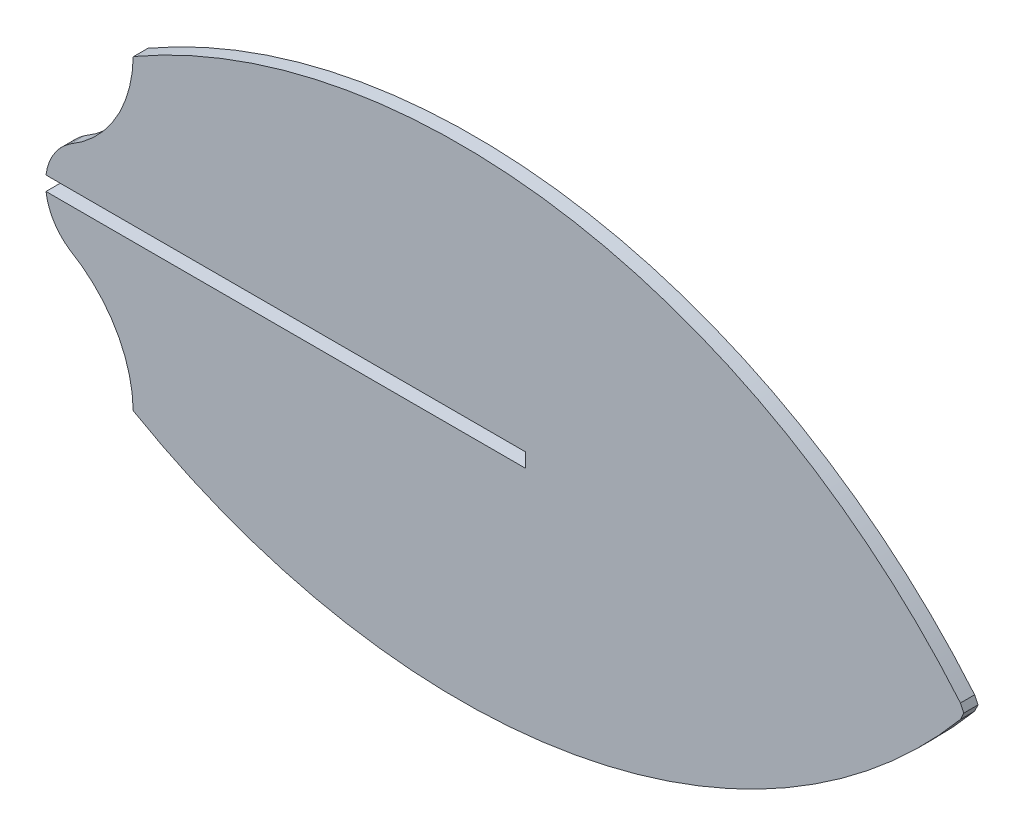
ISO-10303-21;
HEADER;
FILE_DESCRIPTION(('STEP AP214'),'2;1');
FILE_NAME('part.step','',(''),(''),'','','');
FILE_SCHEMA(('AUTOMOTIVE_DESIGN { 1 0 10303 214 1 1 1 1 }'));
ENDSEC;
DATA;
#1=APPLICATION_CONTEXT('core data for automotive mechanical design processes');
#2=APPLICATION_PROTOCOL_DEFINITION('international standard','automotive_design',2000,#1);
#3=PRODUCT_CONTEXT('',#1,'mechanical');
#4=PRODUCT('Part','Part','',(#3));
#5=PRODUCT_RELATED_PRODUCT_CATEGORY('part','',(#4));
#6=PRODUCT_DEFINITION_FORMATION('','',#4);
#7=PRODUCT_DEFINITION_CONTEXT('part definition',#1,'design');
#8=PRODUCT_DEFINITION('design','',#6,#7);
#9=PRODUCT_DEFINITION_SHAPE('','',#8);
#10=(LENGTH_UNIT() NAMED_UNIT(*) SI_UNIT(.MILLI.,.METRE.));
#11=(NAMED_UNIT(*) PLANE_ANGLE_UNIT() SI_UNIT($,.RADIAN.));
#12=(NAMED_UNIT(*) SI_UNIT($,.STERADIAN.) SOLID_ANGLE_UNIT());
#13=UNCERTAINTY_MEASURE_WITH_UNIT(LENGTH_MEASURE(1.E-05),#10,'distance_accuracy_value','');
#14=(GEOMETRIC_REPRESENTATION_CONTEXT(3) GLOBAL_UNCERTAINTY_ASSIGNED_CONTEXT((#13)) GLOBAL_UNIT_ASSIGNED_CONTEXT((#10,
#11,#12)) REPRESENTATION_CONTEXT('',''));
#15=CARTESIAN_POINT('',(0.,0.,0.));
#16=DIRECTION('',(0.,0.,1.));
#17=DIRECTION('',(1.,0.,0.));
#18=AXIS2_PLACEMENT_3D('',#15,#16,#17);
#19=CARTESIAN_POINT('',(79.3571739253671,0.,1.524));
#20=DIRECTION('',(0.,1.,0.));
#21=DIRECTION('',(-1.,0.,0.));
#22=AXIS2_PLACEMENT_3D('',#19,#20,#21);
#23=PLANE('',#22);
#24=DIRECTION('',(1.,0.,0.));
#25=VECTOR('',#24,1.);
#26=CARTESIAN_POINT('',(79.3571739253671,0.,0.));
#27=LINE('',#26,#25);
#28=CARTESIAN_POINT('',(27.9972185609957,0.,0.));
#29=VERTEX_POINT('',#28);
#30=CARTESIAN_POINT('',(79.3571739253671,0.,0.));
#31=VERTEX_POINT('',#30);
#32=EDGE_CURVE('E157',#29,#31,#27,.T.);
#33=ORIENTED_EDGE('',*,*,#32,.T.);
#34=DIRECTION('',(0.,0.,-1.));
#35=VECTOR('',#34,1.);
#36=CARTESIAN_POINT('',(79.3571739253671,0.,1.524));
#37=LINE('',#36,#35);
#38=CARTESIAN_POINT('',(79.3571739253671,0.,1.524));
#39=VERTEX_POINT('',#38);
#40=EDGE_CURVE('E11',#39,#31,#37,.T.);
#41=ORIENTED_EDGE('',*,*,#40,.F.);
#42=DIRECTION('',(1.,0.,0.));
#43=VECTOR('',#42,1.);
#44=CARTESIAN_POINT('',(79.3571739253671,0.,1.524));
#45=LINE('',#44,#43);
#46=CARTESIAN_POINT('',(27.9972185609957,0.,1.524));
#47=VERTEX_POINT('',#46);
#48=EDGE_CURVE('E181',#47,#39,#45,.T.);
#49=ORIENTED_EDGE('',*,*,#48,.F.);
#50=DIRECTION('',(0.,0.,-1.));
#51=VECTOR('',#50,1.);
#52=CARTESIAN_POINT('',(27.9972185609957,0.,1.524));
#53=LINE('',#52,#51);
#54=EDGE_CURVE('E153',#47,#29,#53,.T.);
#55=ORIENTED_EDGE('',*,*,#54,.T.);
#56=EDGE_LOOP('',(#33,#41,#49,#55));
#57=FACE_BOUND('',#56,.T.);
#58=ADVANCED_FACE('F31',(#57),#23,.F.);
#59=CARTESIAN_POINT('',(79.3571739253671,0.,1.524));
#60=DIRECTION('',(1.,0.,0.));
#61=DIRECTION('',(0.,0.,-1.));
#62=AXIS2_PLACEMENT_3D('',#59,#60,#61);
#63=PLANE('',#62);
#64=DIRECTION('',(0.,-1.,0.));
#65=VECTOR('',#64,1.);
#66=CARTESIAN_POINT('',(79.3571739253671,0.,0.));
#67=LINE('',#66,#65);
#68=CARTESIAN_POINT('',(79.3571739253671,-1.524,0.));
#69=VERTEX_POINT('',#68);
#70=EDGE_CURVE('E160',#31,#69,#67,.T.);
#71=ORIENTED_EDGE('',*,*,#70,.T.);
#72=DIRECTION('',(0.,0.,-1.));
#73=VECTOR('',#72,1.);
#74=CARTESIAN_POINT('',(79.3571739253671,-1.524,1.524));
#75=LINE('',#74,#73);
#76=CARTESIAN_POINT('',(79.3571739253671,-1.524,1.524));
#77=VERTEX_POINT('',#76);
#78=EDGE_CURVE('E39',#77,#69,#75,.T.);
#79=ORIENTED_EDGE('',*,*,#78,.F.);
#80=DIRECTION('',(0.,-1.,0.));
#81=VECTOR('',#80,1.);
#82=CARTESIAN_POINT('',(79.3571739253671,0.,1.524));
#83=LINE('',#82,#81);
#84=EDGE_CURVE('E105',#39,#77,#83,.T.);
#85=ORIENTED_EDGE('',*,*,#84,.F.);
#86=ORIENTED_EDGE('',*,*,#40,.T.);
#87=EDGE_LOOP('',(#71,#79,#85,#86));
#88=FACE_BOUND('',#87,.T.);
#89=ADVANCED_FACE('F264',(#88),#63,.F.);
#90=CARTESIAN_POINT('',(79.3571739253671,-1.524,1.524));
#91=DIRECTION('',(0.,-1.,0.));
#92=DIRECTION('',(0.,0.,-1.));
#93=AXIS2_PLACEMENT_3D('',#90,#91,#92);
#94=PLANE('',#93);
#95=DIRECTION('',(-1.,0.,0.));
#96=VECTOR('',#95,1.);
#97=CARTESIAN_POINT('',(79.3571739253671,-1.524,0.));
#98=LINE('',#97,#96);
#99=CARTESIAN_POINT('',(27.9972185609957,-1.524,0.));
#100=VERTEX_POINT('',#99);
#101=EDGE_CURVE('E162',#69,#100,#98,.T.);
#102=ORIENTED_EDGE('',*,*,#101,.T.);
#103=DIRECTION('',(0.,0.,-1.));
#104=VECTOR('',#103,1.);
#105=CARTESIAN_POINT('',(27.9972185609957,-1.524,1.524));
#106=LINE('',#105,#104);
#107=CARTESIAN_POINT('',(27.9972185609957,-1.524,1.524));
#108=VERTEX_POINT('',#107);
#109=EDGE_CURVE('E203',#108,#100,#106,.T.);
#110=ORIENTED_EDGE('',*,*,#109,.F.);
#111=DIRECTION('',(-1.,0.,0.));
#112=VECTOR('',#111,1.);
#113=CARTESIAN_POINT('',(79.3571739253671,-1.524,1.524));
#114=LINE('',#113,#112);
#115=EDGE_CURVE('E211',#77,#108,#114,.T.);
#116=ORIENTED_EDGE('',*,*,#115,.F.);
#117=ORIENTED_EDGE('',*,*,#78,.T.);
#118=EDGE_LOOP('',(#102,#110,#116,#117));
#119=FACE_BOUND('',#118,.T.);
#120=ADVANCED_FACE('F209',(#119),#94,.F.);
#121=CARTESIAN_POINT('',(33.8960418802718,-0.762,1.524));
#122=DIRECTION('',(0.,0.,-1.));
#123=DIRECTION('',(-1.,0.,0.));
#124=AXIS2_PLACEMENT_3D('',#121,#122,#123);
#125=CYLINDRICAL_SURFACE('',#124,5.94783662788713);
#126=CARTESIAN_POINT('',(33.8960418802718,-0.762,0.));
#127=DIRECTION('',(0.,0.,1.));
#128=DIRECTION('',(1.,0.,0.));
#129=AXIS2_PLACEMENT_3D('',#126,#127,#128);
#130=CIRCLE('',#129,5.94783662788713);
#131=CARTESIAN_POINT('',(30.5852724424049,-5.70321101364049,0.));
#132=VERTEX_POINT('',#131);
#133=EDGE_CURVE('E164',#100,#132,#130,.T.);
#134=ORIENTED_EDGE('',*,*,#133,.T.);
#135=DIRECTION('',(0.,0.,-1.));
#136=VECTOR('',#135,1.);
#137=CARTESIAN_POINT('',(30.5852724424049,-5.70321101364049,1.524));
#138=LINE('',#137,#136);
#139=CARTESIAN_POINT('',(30.5852724424049,-5.70321101364049,1.524));
#140=VERTEX_POINT('',#139);
#141=EDGE_CURVE('E200',#140,#132,#138,.T.);
#142=ORIENTED_EDGE('',*,*,#141,.F.);
#143=CARTESIAN_POINT('',(33.8960418802718,-0.762,1.524));
#144=DIRECTION('',(0.,0.,1.));
#145=DIRECTION('',(1.,0.,0.));
#146=AXIS2_PLACEMENT_3D('',#143,#144,#145);
#147=CIRCLE('',#146,5.94783662788713);
#148=EDGE_CURVE('E229',#108,#140,#147,.T.);
#149=ORIENTED_EDGE('',*,*,#148,.F.);
#150=ORIENTED_EDGE('',*,*,#109,.T.);
#151=EDGE_LOOP('',(#134,#142,#149,#150));
#152=FACE_BOUND('',#151,.T.);
#153=ADVANCED_FACE('F220',(#152),#125,.T.);
#154=CARTESIAN_POINT('',(23.8339431214559,-17.4069550048299,1.524));
#155=DIRECTION('',(0.,0.,-1.));
#156=DIRECTION('',(-1.,0.,0.));
#157=AXIS2_PLACEMENT_3D('',#154,#155,#156);
#158=CYLINDRICAL_SURFACE('',#157,13.5114052197101);
#159=CARTESIAN_POINT('',(23.8339431214559,-17.4069550048299,0.));
#160=DIRECTION('',(0.,0.,-1.));
#161=DIRECTION('',(-1.,0.,0.));
#162=AXIS2_PLACEMENT_3D('',#159,#160,#161);
#163=CIRCLE('',#162,13.5114052197101);
#164=CARTESIAN_POINT('',(37.3432489838204,-17.1687825288933,0.));
#165=VERTEX_POINT('',#164);
#166=EDGE_CURVE('E166',#132,#165,#163,.T.);
#167=ORIENTED_EDGE('',*,*,#166,.T.);
#168=DIRECTION('',(0.,0.,-1.));
#169=VECTOR('',#168,1.);
#170=CARTESIAN_POINT('',(37.3432489838204,-17.1687825288933,1.524));
#171=LINE('',#170,#169);
#172=CARTESIAN_POINT('',(37.3432489838204,-17.1687825288933,1.524));
#173=VERTEX_POINT('',#172);
#174=EDGE_CURVE('E197',#173,#165,#171,.T.);
#175=ORIENTED_EDGE('',*,*,#174,.F.);
#176=CARTESIAN_POINT('',(23.8339431214559,-17.4069550048299,1.524));
#177=DIRECTION('',(0.,0.,-1.));
#178=DIRECTION('',(-1.,0.,0.));
#179=AXIS2_PLACEMENT_3D('',#176,#177,#178);
#180=CIRCLE('',#179,13.5114052197101);
#181=EDGE_CURVE('E226',#140,#173,#180,.T.);
#182=ORIENTED_EDGE('',*,*,#181,.F.);
#183=ORIENTED_EDGE('',*,*,#141,.T.);
#184=EDGE_LOOP('',(#167,#175,#182,#183));
#185=FACE_BOUND('',#184,.T.);
#186=ADVANCED_FACE('F224',(#185),#158,.F.);
#187=CARTESIAN_POINT('',(104.20886207179,47.9431791243994,1.524));
#188=DIRECTION('',(0.,0.,-1.));
#189=DIRECTION('',(-1.,0.,0.));
#190=AXIS2_PLACEMENT_3D('',#187,#188,#189);
#191=CYLINDRICAL_SURFACE('',#190,93.3304760727705);
#192=CARTESIAN_POINT('',(104.20886207179,47.9431791243994,0.));
#193=DIRECTION('',(0.,0.,1.));
#194=DIRECTION('',(1.,0.,0.));
#195=AXIS2_PLACEMENT_3D('',#192,#193,#194);
#196=CIRCLE('',#195,93.3304760727705);
#197=CARTESIAN_POINT('',(37.4004903842335,-17.2275139548308,0.));
#198=VERTEX_POINT('',#197);
#199=EDGE_CURVE('E168',#165,#198,#196,.T.);
#200=ORIENTED_EDGE('',*,*,#199,.T.);
#201=DIRECTION('',(0.,0.,-1.));
#202=VECTOR('',#201,1.);
#203=CARTESIAN_POINT('',(37.4004903842335,-17.2275139548308,1.524));
#204=LINE('',#203,#202);
#205=CARTESIAN_POINT('',(37.4004903842335,-17.2275139548308,1.524));
#206=VERTEX_POINT('',#205);
#207=EDGE_CURVE('E194',#206,#198,#204,.T.);
#208=ORIENTED_EDGE('',*,*,#207,.F.);
#209=CARTESIAN_POINT('',(104.20886207179,47.9431791243994,1.524));
#210=DIRECTION('',(0.,0.,1.));
#211=DIRECTION('',(1.,0.,0.));
#212=AXIS2_PLACEMENT_3D('',#209,#210,#211);
#213=CIRCLE('',#212,93.3304760727705);
#214=EDGE_CURVE('E228',#173,#206,#213,.T.);
#215=ORIENTED_EDGE('',*,*,#214,.F.);
#216=ORIENTED_EDGE('',*,*,#174,.T.);
#217=EDGE_LOOP('',(#200,#208,#215,#216));
#218=FACE_BOUND('',#217,.T.);
#219=ADVANCED_FACE('F277',(#218),#191,.T.);
#220=CARTESIAN_POINT('',(72.3276120310768,43.4181033704036,1.524));
#221=DIRECTION('',(0.,0.,-1.));
#222=DIRECTION('',(-1.,0.,0.));
#223=AXIS2_PLACEMENT_3D('',#220,#221,#222);
#224=CYLINDRICAL_SURFACE('',#223,69.9842462793745);
#225=CARTESIAN_POINT('',(72.3276120310768,43.4181033704036,0.));
#226=DIRECTION('',(0.,0.,1.));
#227=DIRECTION('',(1.,0.,0.));
#228=AXIS2_PLACEMENT_3D('',#225,#226,#227);
#229=CIRCLE('',#228,69.9842462793745);
#230=CARTESIAN_POINT('',(125.974625665911,-1.52400000000002,0.));
#231=VERTEX_POINT('',#230);
#232=EDGE_CURVE('E170',#198,#231,#229,.T.);
#233=ORIENTED_EDGE('',*,*,#232,.T.);
#234=DIRECTION('',(0.,0.,-1.));
#235=VECTOR('',#234,1.);
#236=CARTESIAN_POINT('',(125.974625665911,-1.52400000000002,1.524));
#237=LINE('',#236,#235);
#238=CARTESIAN_POINT('',(125.974625665911,-1.52400000000002,1.524));
#239=VERTEX_POINT('',#238);
#240=EDGE_CURVE('E191',#239,#231,#237,.T.);
#241=ORIENTED_EDGE('',*,*,#240,.F.);
#242=CARTESIAN_POINT('',(72.3276120310768,43.4181033704036,1.524));
#243=DIRECTION('',(0.,0.,1.));
#244=DIRECTION('',(1.,0.,0.));
#245=AXIS2_PLACEMENT_3D('',#242,#243,#244);
#246=CIRCLE('',#245,69.9842462793745);
#247=EDGE_CURVE('E231',#206,#239,#246,.T.);
#248=ORIENTED_EDGE('',*,*,#247,.F.);
#249=ORIENTED_EDGE('',*,*,#207,.T.);
#250=EDGE_LOOP('',(#233,#241,#248,#249));
#251=FACE_BOUND('',#250,.T.);
#252=ADVANCED_FACE('F280',(#251),#224,.T.);
#253=CARTESIAN_POINT('',(126.331576391124,-0.762,1.524));
#254=DIRECTION('',(-0.905567044958609,0.424203167226427,0.));
#255=DIRECTION('',(-0.424203167226427,-0.905567044958609,0.));
#256=AXIS2_PLACEMENT_3D('',#253,#254,#255);
#257=PLANE('',#256);
#258=DIRECTION('',(0.424203167226427,0.905567044958609,0.));
#259=VECTOR('',#258,1.);
#260=CARTESIAN_POINT('',(126.331576391124,-0.762,0.));
#261=LINE('',#260,#259);
#262=CARTESIAN_POINT('',(126.331576391124,-0.762,0.));
#263=VERTEX_POINT('',#262);
#264=EDGE_CURVE('E172',#231,#263,#261,.T.);
#265=ORIENTED_EDGE('',*,*,#264,.T.);
#266=DIRECTION('',(0.,0.,-1.));
#267=VECTOR('',#266,1.);
#268=CARTESIAN_POINT('',(126.331576391124,-0.762,1.524));
#269=LINE('',#268,#267);
#270=CARTESIAN_POINT('',(126.331576391124,-0.762,1.524));
#271=VERTEX_POINT('',#270);
#272=EDGE_CURVE('E188',#271,#263,#269,.T.);
#273=ORIENTED_EDGE('',*,*,#272,.F.);
#274=DIRECTION('',(0.424203167226427,0.905567044958609,0.));
#275=VECTOR('',#274,1.);
#276=CARTESIAN_POINT('',(126.331576391124,-0.762,1.524));
#277=LINE('',#276,#275);
#278=EDGE_CURVE('E237',#239,#271,#277,.T.);
#279=ORIENTED_EDGE('',*,*,#278,.F.);
#280=ORIENTED_EDGE('',*,*,#240,.T.);
#281=EDGE_LOOP('',(#265,#273,#279,#280));
#282=FACE_BOUND('',#281,.T.);
#283=ADVANCED_FACE('F284',(#282),#257,.F.);
#284=CARTESIAN_POINT('',(126.331576391124,-0.762,1.524));
#285=DIRECTION('',(-0.905567044958609,-0.424203167226427,0.));
#286=DIRECTION('',(0.424203167226427,-0.905567044958609,0.));
#287=AXIS2_PLACEMENT_3D('',#284,#285,#286);
#288=PLANE('',#287);
#289=DIRECTION('',(-0.424203167226427,0.905567044958609,0.));
#290=VECTOR('',#289,1.);
#291=CARTESIAN_POINT('',(126.331576391124,-0.762,0.));
#292=LINE('',#291,#290);
#293=CARTESIAN_POINT('',(125.974625665911,0.,0.));
#294=VERTEX_POINT('',#293);
#295=EDGE_CURVE('E174',#263,#294,#292,.T.);
#296=ORIENTED_EDGE('',*,*,#295,.T.);
#297=DIRECTION('',(0.,0.,-1.));
#298=VECTOR('',#297,1.);
#299=CARTESIAN_POINT('',(125.974625665911,0.,1.524));
#300=LINE('',#299,#298);
#301=CARTESIAN_POINT('',(125.974625665911,0.,1.524));
#302=VERTEX_POINT('',#301);
#303=EDGE_CURVE('E185',#302,#294,#300,.T.);
#304=ORIENTED_EDGE('',*,*,#303,.F.);
#305=DIRECTION('',(-0.424203167226427,0.905567044958609,0.));
#306=VECTOR('',#305,1.);
#307=CARTESIAN_POINT('',(126.331576391124,-0.762,1.524));
#308=LINE('',#307,#306);
#309=EDGE_CURVE('E239',#271,#302,#308,.T.);
#310=ORIENTED_EDGE('',*,*,#309,.F.);
#311=ORIENTED_EDGE('',*,*,#272,.T.);
#312=EDGE_LOOP('',(#296,#304,#310,#311));
#313=FACE_BOUND('',#312,.T.);
#314=ADVANCED_FACE('F245',(#313),#288,.F.);
#315=CARTESIAN_POINT('',(72.3276120310768,-44.9421033704036,1.524));
#316=DIRECTION('',(0.,0.,-1.));
#317=DIRECTION('',(-1.,0.,0.));
#318=AXIS2_PLACEMENT_3D('',#315,#316,#317);
#319=CYLINDRICAL_SURFACE('',#318,69.9842462793745);
#320=CARTESIAN_POINT('',(72.3276120310768,-44.9421033704036,0.));
#321=DIRECTION('',(0.,0.,1.));
#322=DIRECTION('',(-1.,0.,0.));
#323=AXIS2_PLACEMENT_3D('',#320,#321,#322);
#324=CIRCLE('',#323,69.9842462793745);
#325=CARTESIAN_POINT('',(37.4004903842335,15.7035139548308,0.));
#326=VERTEX_POINT('',#325);
#327=EDGE_CURVE('E176',#294,#326,#324,.T.);
#328=ORIENTED_EDGE('',*,*,#327,.T.);
#329=DIRECTION('',(0.,0.,-1.));
#330=VECTOR('',#329,1.);
#331=CARTESIAN_POINT('',(37.4004903842335,15.7035139548308,1.524));
#332=LINE('',#331,#330);
#333=CARTESIAN_POINT('',(37.4004903842335,15.7035139548308,1.524));
#334=VERTEX_POINT('',#333);
#335=EDGE_CURVE('E148',#334,#326,#332,.T.);
#336=ORIENTED_EDGE('',*,*,#335,.F.);
#337=CARTESIAN_POINT('',(72.3276120310768,-44.9421033704036,1.524));
#338=DIRECTION('',(0.,0.,1.));
#339=DIRECTION('',(-1.,0.,0.));
#340=AXIS2_PLACEMENT_3D('',#337,#338,#339);
#341=CIRCLE('',#340,69.9842462793745);
#342=EDGE_CURVE('E139',#302,#334,#341,.T.);
#343=ORIENTED_EDGE('',*,*,#342,.F.);
#344=ORIENTED_EDGE('',*,*,#303,.T.);
#345=EDGE_LOOP('',(#328,#336,#343,#344));
#346=FACE_BOUND('',#345,.T.);
#347=ADVANCED_FACE('F249',(#346),#319,.T.);
#348=CARTESIAN_POINT('',(104.20886207179,-49.4671791243994,1.524));
#349=DIRECTION('',(0.,0.,-1.));
#350=DIRECTION('',(-1.,0.,0.));
#351=AXIS2_PLACEMENT_3D('',#348,#349,#350);
#352=CYLINDRICAL_SURFACE('',#351,93.3304760727705);
#353=CARTESIAN_POINT('',(104.20886207179,-49.4671791243994,0.));
#354=DIRECTION('',(0.,0.,1.));
#355=DIRECTION('',(-1.,0.,0.));
#356=AXIS2_PLACEMENT_3D('',#353,#354,#355);
#357=CIRCLE('',#356,93.3304760727705);
#358=CARTESIAN_POINT('',(37.3432489838204,15.6447825288933,0.));
#359=VERTEX_POINT('',#358);
#360=EDGE_CURVE('E147',#326,#359,#357,.T.);
#361=ORIENTED_EDGE('',*,*,#360,.T.);
#362=DIRECTION('',(0.,0.,-1.));
#363=VECTOR('',#362,1.);
#364=CARTESIAN_POINT('',(37.3432489838204,15.6447825288933,1.524));
#365=LINE('',#364,#363);
#366=CARTESIAN_POINT('',(37.3432489838204,15.6447825288933,1.524));
#367=VERTEX_POINT('',#366);
#368=EDGE_CURVE('E144',#367,#359,#365,.T.);
#369=ORIENTED_EDGE('',*,*,#368,.F.);
#370=CARTESIAN_POINT('',(104.20886207179,-49.4671791243994,1.524));
#371=DIRECTION('',(0.,0.,1.));
#372=DIRECTION('',(-1.,0.,0.));
#373=AXIS2_PLACEMENT_3D('',#370,#371,#372);
#374=CIRCLE('',#373,93.3304760727705);
#375=EDGE_CURVE('E133',#334,#367,#374,.T.);
#376=ORIENTED_EDGE('',*,*,#375,.F.);
#377=ORIENTED_EDGE('',*,*,#335,.T.);
#378=EDGE_LOOP('',(#361,#369,#376,#377));
#379=FACE_BOUND('',#378,.T.);
#380=ADVANCED_FACE('F145',(#379),#352,.T.);
#381=CARTESIAN_POINT('',(23.8339431214559,15.8829550048299,1.524));
#382=DIRECTION('',(0.,0.,-1.));
#383=DIRECTION('',(-1.,0.,0.));
#384=AXIS2_PLACEMENT_3D('',#381,#382,#383);
#385=CYLINDRICAL_SURFACE('',#384,13.5114052197101);
#386=CARTESIAN_POINT('',(23.8339431214559,15.8829550048299,0.));
#387=DIRECTION('',(0.,0.,-1.));
#388=DIRECTION('',(1.,0.,0.));
#389=AXIS2_PLACEMENT_3D('',#386,#387,#388);
#390=CIRCLE('',#389,13.5114052197101);
#391=CARTESIAN_POINT('',(30.5852724424049,4.17921101364048,0.));
#392=VERTEX_POINT('',#391);
#393=EDGE_CURVE('E91',#359,#392,#390,.T.);
#394=ORIENTED_EDGE('',*,*,#393,.T.);
#395=DIRECTION('',(0.,0.,-1.));
#396=VECTOR('',#395,1.);
#397=CARTESIAN_POINT('',(30.5852724424049,4.17921101364048,1.524));
#398=LINE('',#397,#396);
#399=CARTESIAN_POINT('',(30.5852724424049,4.17921101364048,1.524));
#400=VERTEX_POINT('',#399);
#401=EDGE_CURVE('E149',#400,#392,#398,.T.);
#402=ORIENTED_EDGE('',*,*,#401,.F.);
#403=CARTESIAN_POINT('',(23.8339431214559,15.8829550048299,1.524));
#404=DIRECTION('',(0.,0.,-1.));
#405=DIRECTION('',(1.,0.,0.));
#406=AXIS2_PLACEMENT_3D('',#403,#404,#405);
#407=CIRCLE('',#406,13.5114052197101);
#408=EDGE_CURVE('E137',#367,#400,#407,.T.);
#409=ORIENTED_EDGE('',*,*,#408,.F.);
#410=ORIENTED_EDGE('',*,*,#368,.T.);
#411=EDGE_LOOP('',(#394,#402,#409,#410));
#412=FACE_BOUND('',#411,.T.);
#413=ADVANCED_FACE('F151',(#412),#385,.F.);
#414=CARTESIAN_POINT('',(33.8960418802718,-0.762,1.524));
#415=DIRECTION('',(0.,0.,-1.));
#416=DIRECTION('',(-1.,0.,0.));
#417=AXIS2_PLACEMENT_3D('',#414,#415,#416);
#418=CYLINDRICAL_SURFACE('',#417,5.94783662788713);
#419=CARTESIAN_POINT('',(33.8960418802718,-0.762,0.));
#420=DIRECTION('',(0.,0.,1.));
#421=DIRECTION('',(1.,0.,0.));
#422=AXIS2_PLACEMENT_3D('',#419,#420,#421);
#423=CIRCLE('',#422,5.94783662788713);
#424=EDGE_CURVE('E97',#392,#29,#423,.T.);
#425=ORIENTED_EDGE('',*,*,#424,.T.);
#426=ORIENTED_EDGE('',*,*,#54,.F.);
#427=CARTESIAN_POINT('',(33.8960418802718,-0.762,1.524));
#428=DIRECTION('',(0.,0.,1.));
#429=DIRECTION('',(1.,0.,0.));
#430=AXIS2_PLACEMENT_3D('',#427,#428,#429);
#431=CIRCLE('',#430,5.94783662788713);
#432=EDGE_CURVE('E47',#400,#47,#431,.T.);
#433=ORIENTED_EDGE('',*,*,#432,.F.);
#434=ORIENTED_EDGE('',*,*,#401,.T.);
#435=EDGE_LOOP('',(#425,#426,#433,#434));
#436=FACE_BOUND('',#435,.T.);
#437=ADVANCED_FACE('F253',(#436),#418,.T.);
#438=CARTESIAN_POINT('',(33.8960418802718,-0.762,1.524));
#439=DIRECTION('',(0.,0.,1.));
#440=DIRECTION('',(1.,0.,0.));
#441=AXIS2_PLACEMENT_3D('',#438,#439,#440);
#442=PLANE('',#441);
#443=ORIENTED_EDGE('',*,*,#48,.T.);
#444=ORIENTED_EDGE('',*,*,#84,.T.);
#445=ORIENTED_EDGE('',*,*,#115,.T.);
#446=ORIENTED_EDGE('',*,*,#148,.T.);
#447=ORIENTED_EDGE('',*,*,#181,.T.);
#448=ORIENTED_EDGE('',*,*,#214,.T.);
#449=ORIENTED_EDGE('',*,*,#247,.T.);
#450=ORIENTED_EDGE('',*,*,#278,.T.);
#451=ORIENTED_EDGE('',*,*,#309,.T.);
#452=ORIENTED_EDGE('',*,*,#342,.T.);
#453=ORIENTED_EDGE('',*,*,#375,.T.);
#454=ORIENTED_EDGE('',*,*,#408,.T.);
#455=ORIENTED_EDGE('',*,*,#432,.T.);
#456=EDGE_LOOP('',(#443,#444,#445,#446,#447,#448,#449,#450,#451,#452,#453,#454,#455));
#457=FACE_BOUND('',#456,.T.);
#458=ADVANCED_FACE('F135',(#457),#442,.T.);
#459=CARTESIAN_POINT('',(33.8960418802718,-0.762,0.));
#460=DIRECTION('',(0.,0.,1.));
#461=DIRECTION('',(1.,0.,0.));
#462=AXIS2_PLACEMENT_3D('',#459,#460,#461);
#463=PLANE('',#462);
#464=ORIENTED_EDGE('',*,*,#32,.F.);
#465=ORIENTED_EDGE('',*,*,#424,.F.);
#466=ORIENTED_EDGE('',*,*,#393,.F.);
#467=ORIENTED_EDGE('',*,*,#360,.F.);
#468=ORIENTED_EDGE('',*,*,#327,.F.);
#469=ORIENTED_EDGE('',*,*,#295,.F.);
#470=ORIENTED_EDGE('',*,*,#264,.F.);
#471=ORIENTED_EDGE('',*,*,#232,.F.);
#472=ORIENTED_EDGE('',*,*,#199,.F.);
#473=ORIENTED_EDGE('',*,*,#166,.F.);
#474=ORIENTED_EDGE('',*,*,#133,.F.);
#475=ORIENTED_EDGE('',*,*,#101,.F.);
#476=ORIENTED_EDGE('',*,*,#70,.F.);
#477=EDGE_LOOP('',(#464,#465,#466,#467,#468,#469,#470,#471,#472,#473,#474,#475,#476));
#478=FACE_BOUND('',#477,.T.);
#479=ADVANCED_FACE('F215',(#478),#463,.F.);
#480=CLOSED_SHELL('',(#58,#89,#120,#153,#186,#219,#252,#283,#314,#347,#380,#413,#437,#458,#479));
#481=MANIFOLD_SOLID_BREP('B2',#480);
#482=ADVANCED_BREP_SHAPE_REPRESENTATION('',(#18,#481),#14);
#483=SHAPE_DEFINITION_REPRESENTATION(#9,#482);
ENDSEC;
END-ISO-10303-21;
